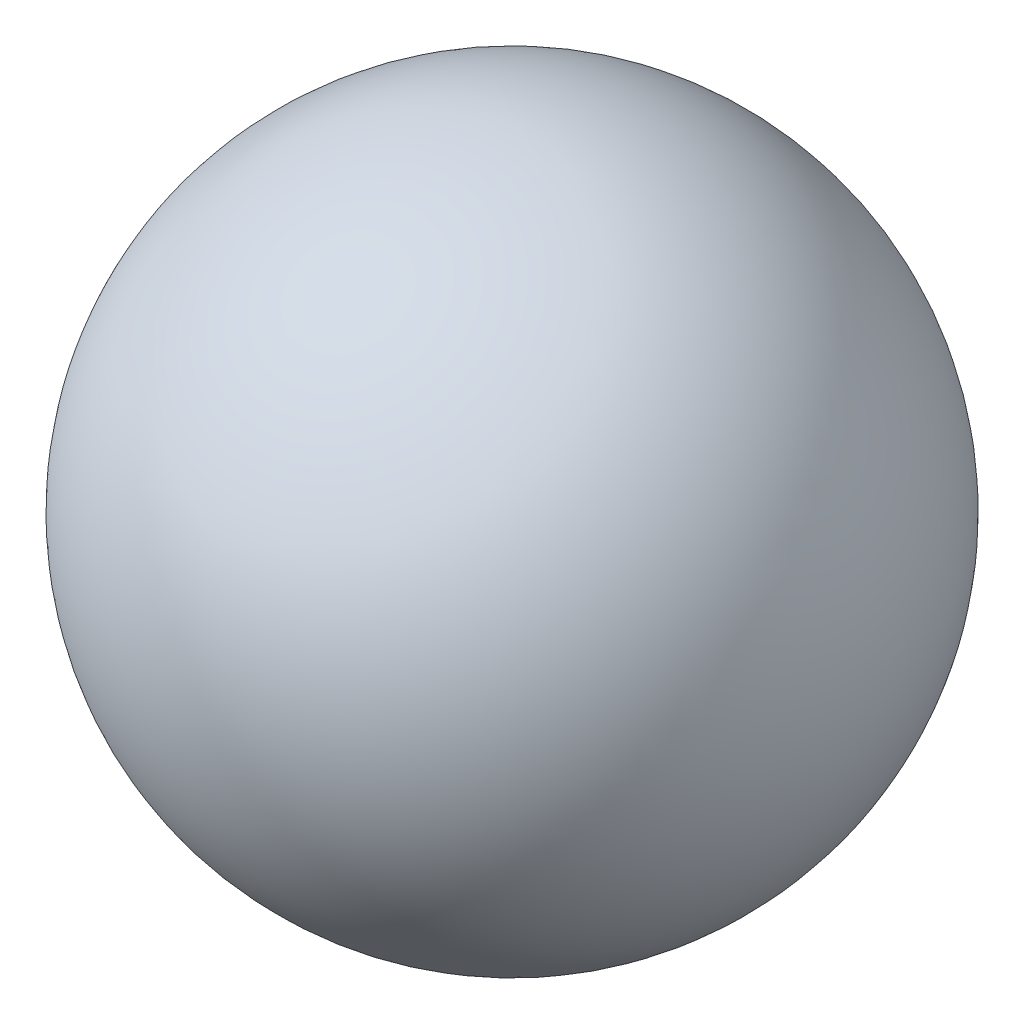
ISO-10303-21;
HEADER;
FILE_DESCRIPTION(('STEP AP214'),'2;1');
FILE_NAME('part.step','',(''),(''),'','','');
FILE_SCHEMA(('AUTOMOTIVE_DESIGN { 1 0 10303 214 1 1 1 1 }'));
ENDSEC;
DATA;
#1=APPLICATION_CONTEXT('core data for automotive mechanical design processes');
#2=APPLICATION_PROTOCOL_DEFINITION('international standard','automotive_design',2000,#1);
#3=PRODUCT_CONTEXT('',#1,'mechanical');
#4=PRODUCT('Part','Part','',(#3));
#5=PRODUCT_RELATED_PRODUCT_CATEGORY('part','',(#4));
#6=PRODUCT_DEFINITION_FORMATION('','',#4);
#7=PRODUCT_DEFINITION_CONTEXT('part definition',#1,'design');
#8=PRODUCT_DEFINITION('design','',#6,#7);
#9=PRODUCT_DEFINITION_SHAPE('','',#8);
#10=(LENGTH_UNIT() NAMED_UNIT(*) SI_UNIT(.MILLI.,.METRE.));
#11=(NAMED_UNIT(*) PLANE_ANGLE_UNIT() SI_UNIT($,.RADIAN.));
#12=(NAMED_UNIT(*) SI_UNIT($,.STERADIAN.) SOLID_ANGLE_UNIT());
#13=UNCERTAINTY_MEASURE_WITH_UNIT(LENGTH_MEASURE(1.E-05),#10,'distance_accuracy_value','');
#14=(GEOMETRIC_REPRESENTATION_CONTEXT(3) GLOBAL_UNCERTAINTY_ASSIGNED_CONTEXT((#13)) GLOBAL_UNIT_ASSIGNED_CONTEXT((#10,
#11,#12)) REPRESENTATION_CONTEXT('',''));
#15=CARTESIAN_POINT('',(0.,0.,0.));
#16=DIRECTION('',(0.,0.,1.));
#17=DIRECTION('',(1.,0.,0.));
#18=AXIS2_PLACEMENT_3D('',#15,#16,#17);
#19=CARTESIAN_POINT('',(0.,0.,0.));
#20=DIRECTION('',(1.,0.,0.));
#21=DIRECTION('',(0.,-1.,0.));
#22=AXIS2_PLACEMENT_3D('',#19,#20,#21);
#23=SPHERICAL_SURFACE('',#22,25.5);
#24=CARTESIAN_POINT('',(25.5,0.,0.));
#25=VERTEX_POINT('',#24);
#26=VERTEX_LOOP('',#25);
#27=FACE_BOUND('',#26,.T.);
#28=ADVANCED_FACE('F38',(#27),#23,.T.);
#29=CLOSED_SHELL('',(#28));
#30=CARTESIAN_POINT('',(0.,0.,0.));
#31=DIRECTION('',(1.,0.,0.));
#32=DIRECTION('',(0.,-1.,0.));
#33=AXIS2_PLACEMENT_3D('',#30,#31,#32);
#34=SPHERICAL_SURFACE('',#33,5.);
#35=CARTESIAN_POINT('',(0.,0.,-4.44322333746908));
#36=DIRECTION('',(0.,0.,1.));
#37=DIRECTION('',(1.,0.,0.));
#38=AXIS2_PLACEMENT_3D('',#35,#36,#37);
#39=CIRCLE('',#38,2.29298198278358);
#40=CARTESIAN_POINT('',(2.29298198278358,0.,-4.44322333746908));
#41=VERTEX_POINT('',#40);
#42=EDGE_CURVE('E10',#41,#41,#39,.T.);
#43=ORIENTED_EDGE('',*,*,#42,.T.);
#44=EDGE_LOOP('',(#43));
#45=FACE_BOUND('',#44,.T.);
#46=CARTESIAN_POINT('',(0.,4.44322333746908,0.));
#47=DIRECTION('',(0.,-1.,0.));
#48=DIRECTION('',(1.,0.,0.));
#49=AXIS2_PLACEMENT_3D('',#46,#47,#48);
#50=CIRCLE('',#49,2.29298198278358);
#51=CARTESIAN_POINT('',(2.29298198278358,4.44322333746908,0.));
#52=VERTEX_POINT('',#51);
#53=EDGE_CURVE('E75',#52,#52,#50,.T.);
#54=ORIENTED_EDGE('',*,*,#53,.T.);
#55=EDGE_LOOP('',(#54));
#56=FACE_BOUND('',#55,.T.);
#57=CARTESIAN_POINT('',(4.44322333746908,0.,0.));
#58=DIRECTION('',(-1.,0.,0.));
#59=DIRECTION('',(0.,0.,1.));
#60=AXIS2_PLACEMENT_3D('',#57,#58,#59);
#61=CIRCLE('',#60,2.29298198278358);
#62=CARTESIAN_POINT('',(4.44322333746908,0.,2.29298198278358));
#63=VERTEX_POINT('',#62);
#64=EDGE_CURVE('E99',#63,#63,#61,.T.);
#65=ORIENTED_EDGE('',*,*,#64,.T.);
#66=EDGE_LOOP('',(#65));
#67=FACE_BOUND('',#66,.T.);
#68=CARTESIAN_POINT('',(-4.44322333746908,0.,0.));
#69=DIRECTION('',(1.,0.,0.));
#70=DIRECTION('',(0.,0.,-1.));
#71=AXIS2_PLACEMENT_3D('',#68,#69,#70);
#72=CIRCLE('',#71,2.29298198278358);
#73=CARTESIAN_POINT('',(-4.44322333746908,0.,-2.29298198278358));
#74=VERTEX_POINT('',#73);
#75=EDGE_CURVE('E111',#74,#74,#72,.T.);
#76=ORIENTED_EDGE('',*,*,#75,.T.);
#77=EDGE_LOOP('',(#76));
#78=FACE_BOUND('',#77,.T.);
#79=CARTESIAN_POINT('',(0.,-4.44322333746908,0.));
#80=DIRECTION('',(0.,1.,0.));
#81=DIRECTION('',(-1.,0.,0.));
#82=AXIS2_PLACEMENT_3D('',#79,#80,#81);
#83=CIRCLE('',#82,2.29298198278358);
#84=CARTESIAN_POINT('',(-2.29298198278358,-4.44322333746908,0.));
#85=VERTEX_POINT('',#84);
#86=EDGE_CURVE('E87',#85,#85,#83,.T.);
#87=ORIENTED_EDGE('',*,*,#86,.T.);
#88=EDGE_LOOP('',(#87));
#89=FACE_BOUND('',#88,.T.);
#90=CARTESIAN_POINT('',(0.,0.,4.44322333746908));
#91=DIRECTION('',(0.,0.,-1.));
#92=DIRECTION('',(-1.,0.,0.));
#93=AXIS2_PLACEMENT_3D('',#90,#91,#92);
#94=CIRCLE('',#93,2.29298198278358);
#95=CARTESIAN_POINT('',(-2.29298198278358,0.,4.44322333746908));
#96=VERTEX_POINT('',#95);
#97=EDGE_CURVE('E63',#96,#96,#94,.T.);
#98=ORIENTED_EDGE('',*,*,#97,.T.);
#99=EDGE_LOOP('',(#98));
#100=FACE_BOUND('',#99,.T.);
#101=ADVANCED_FACE('F145',(#45,#56,#67,#78,#89,#100),#34,.T.);
#102=CARTESIAN_POINT('',(0.,0.,0.));
#103=DIRECTION('',(1.,0.,0.));
#104=DIRECTION('',(0.,-1.,0.));
#105=AXIS2_PLACEMENT_3D('',#102,#103,#104);
#106=SPHERICAL_SURFACE('',#105,25.);
#107=CARTESIAN_POINT('',(0.,0.,-22.2766061907567));
#108=DIRECTION('',(0.,0.,1.));
#109=DIRECTION('',(1.,0.,0.));
#110=AXIS2_PLACEMENT_3D('',#107,#108,#109);
#111=CIRCLE('',#110,11.3469298324234);
#112=CARTESIAN_POINT('',(11.3469298324233,0.,-22.2766061907567));
#113=VERTEX_POINT('',#112);
#114=EDGE_CURVE('E53',#113,#113,#111,.F.);
#115=ORIENTED_EDGE('',*,*,#114,.T.);
#116=EDGE_LOOP('',(#115));
#117=FACE_BOUND('',#116,.T.);
#118=CARTESIAN_POINT('',(0.,22.2766061907567,0.));
#119=DIRECTION('',(0.,-1.,0.));
#120=DIRECTION('',(1.,0.,0.));
#121=AXIS2_PLACEMENT_3D('',#118,#119,#120);
#122=CIRCLE('',#121,11.3469298324233);
#123=CARTESIAN_POINT('',(11.3469298324233,22.2766061907567,0.));
#124=VERTEX_POINT('',#123);
#125=EDGE_CURVE('E81',#124,#124,#122,.F.);
#126=ORIENTED_EDGE('',*,*,#125,.T.);
#127=EDGE_LOOP('',(#126));
#128=FACE_BOUND('',#127,.T.);
#129=CARTESIAN_POINT('',(22.2766061907567,0.,0.));
#130=DIRECTION('',(-1.,0.,0.));
#131=DIRECTION('',(0.,0.,1.));
#132=AXIS2_PLACEMENT_3D('',#129,#130,#131);
#133=CIRCLE('',#132,11.3469298324233);
#134=CARTESIAN_POINT('',(22.2766061907567,0.,11.3469298324233));
#135=VERTEX_POINT('',#134);
#136=EDGE_CURVE('E105',#135,#135,#133,.F.);
#137=ORIENTED_EDGE('',*,*,#136,.T.);
#138=EDGE_LOOP('',(#137));
#139=FACE_BOUND('',#138,.T.);
#140=CARTESIAN_POINT('',(-22.2766061907567,0.,0.));
#141=DIRECTION('',(1.,0.,0.));
#142=DIRECTION('',(0.,0.,-1.));
#143=AXIS2_PLACEMENT_3D('',#140,#141,#142);
#144=CIRCLE('',#143,11.3469298324233);
#145=CARTESIAN_POINT('',(-22.2766061907567,0.,-11.3469298324233));
#146=VERTEX_POINT('',#145);
#147=EDGE_CURVE('E121',#146,#146,#144,.F.);
#148=ORIENTED_EDGE('',*,*,#147,.T.);
#149=EDGE_LOOP('',(#148));
#150=FACE_BOUND('',#149,.T.);
#151=CARTESIAN_POINT('',(0.,-22.2766061907567,0.));
#152=DIRECTION('',(0.,1.,0.));
#153=DIRECTION('',(-1.,0.,0.));
#154=AXIS2_PLACEMENT_3D('',#151,#152,#153);
#155=CIRCLE('',#154,11.3469298324233);
#156=CARTESIAN_POINT('',(-11.3469298324234,-22.2766061907567,0.));
#157=VERTEX_POINT('',#156);
#158=EDGE_CURVE('E93',#157,#157,#155,.F.);
#159=ORIENTED_EDGE('',*,*,#158,.T.);
#160=EDGE_LOOP('',(#159));
#161=FACE_BOUND('',#160,.T.);
#162=CARTESIAN_POINT('',(0.,0.,22.2766061907567));
#163=DIRECTION('',(0.,0.,-1.));
#164=DIRECTION('',(-1.,0.,0.));
#165=AXIS2_PLACEMENT_3D('',#162,#163,#164);
#166=CIRCLE('',#165,11.3469298324234);
#167=CARTESIAN_POINT('',(-11.3469298324233,0.,22.2766061907567));
#168=VERTEX_POINT('',#167);
#169=EDGE_CURVE('E69',#168,#168,#166,.F.);
#170=ORIENTED_EDGE('',*,*,#169,.T.);
#171=EDGE_LOOP('',(#170));
#172=FACE_BOUND('',#171,.T.);
#173=ADVANCED_FACE('F141',(#117,#128,#139,#150,#161,#172),#106,.F.);
#174=CARTESIAN_POINT('',(-25.,2.,0.));
#175=CARTESIAN_POINT('',(-15.9439065547574,-0.257937692263543,0.));
#176=CARTESIAN_POINT('',(-9.05609344524264,-0.257937692263541,0.));
#177=CARTESIAN_POINT('',(0.,2.,0.));
#178=B_SPLINE_CURVE_WITH_KNOTS('',3,(#174,#175,#176,#177),.UNSPECIFIED.,.F.,.F.,(4,4),(0.,1.),.UNSPECIFIED.);
#179=CARTESIAN_POINT('',(0.,0.,0.));
#180=DIRECTION('',(1.,0.,0.));
#181=AXIS1_PLACEMENT('',#179,#180);
#182=SURFACE_OF_REVOLUTION('',#178,#181);
#183=CARTESIAN_POINT('',(-6.71817886282011,0.,0.));
#184=DIRECTION('',(1.,0.,0.));
#185=DIRECTION('',(0.,0.,-1.));
#186=AXIS2_PLACEMENT_3D('',#183,#184,#185);
#187=CIRCLE('',#186,0.694357645315852);
#188=CARTESIAN_POINT('',(-6.71817886282011,0.,-0.694357645315852));
#189=VERTEX_POINT('',#188);
#190=EDGE_CURVE('E114',#189,#189,#187,.F.);
#191=ORIENTED_EDGE('',*,*,#190,.T.);
#192=EDGE_LOOP('',(#191));
#193=FACE_BOUND('',#192,.T.);
#194=CARTESIAN_POINT('',(-16.244846792707,0.,0.));
#195=DIRECTION('',(1.,0.,0.));
#196=DIRECTION('',(0.,0.,-1.));
#197=AXIS2_PLACEMENT_3D('',#194,#195,#196);
#198=CIRCLE('',#197,0.471177087042309);
#199=CARTESIAN_POINT('',(-16.244846792707,0.,-0.471177087042309));
#200=VERTEX_POINT('',#199);
#201=EDGE_CURVE('E118',#200,#200,#198,.T.);
#202=ORIENTED_EDGE('',*,*,#201,.T.);
#203=EDGE_LOOP('',(#202));
#204=FACE_BOUND('',#203,.T.);
#205=ADVANCED_FACE('F136',(#193,#204),#182,.T.);
#206=CARTESIAN_POINT('',(-15.5936243335297,0.,0.));
#207=DIRECTION('',(1.,0.,0.));
#208=DIRECTION('',(0.,0.,-1.));
#209=AXIS2_PLACEMENT_3D('',#206,#207,#208);
#210=TOROIDAL_SURFACE('',#209,7.94285088269634,7.5);
#211=ORIENTED_EDGE('',*,*,#201,.F.);
#212=EDGE_LOOP('',(#211));
#213=FACE_BOUND('',#212,.T.);
#214=ORIENTED_EDGE('',*,*,#147,.F.);
#215=EDGE_LOOP('',(#214));
#216=FACE_BOUND('',#215,.T.);
#217=ADVANCED_FACE('F140',(#213,#216),#210,.F.);
#218=CARTESIAN_POINT('',(-7.10915733995053,0.,0.));
#219=DIRECTION('',(1.,0.,0.));
#220=DIRECTION('',(0.,0.,-1.));
#221=AXIS2_PLACEMENT_3D('',#218,#219,#220);
#222=TOROIDAL_SURFACE('',#221,3.66877117245373,3.);
#223=ORIENTED_EDGE('',*,*,#75,.F.);
#224=EDGE_LOOP('',(#223));
#225=FACE_BOUND('',#224,.T.);
#226=ORIENTED_EDGE('',*,*,#190,.F.);
#227=EDGE_LOOP('',(#226));
#228=FACE_BOUND('',#227,.T.);
#229=ADVANCED_FACE('F150',(#225,#228),#222,.F.);
#230=CARTESIAN_POINT('',(25.,2.,0.));
#231=CARTESIAN_POINT('',(15.9439065547574,-0.257937692263543,0.));
#232=CARTESIAN_POINT('',(9.05609344524264,-0.257937692263541,0.));
#233=CARTESIAN_POINT('',(0.,2.,0.));
#234=B_SPLINE_CURVE_WITH_KNOTS('',3,(#230,#231,#232,#233),.UNSPECIFIED.,.F.,.F.,(4,4),(0.,1.),.UNSPECIFIED.);
#235=CARTESIAN_POINT('',(0.,0.,0.));
#236=DIRECTION('',(-1.,0.,0.));
#237=AXIS1_PLACEMENT('',#235,#236);
#238=SURFACE_OF_REVOLUTION('',#234,#237);
#239=CARTESIAN_POINT('',(6.71817886282011,0.,0.));
#240=DIRECTION('',(-1.,0.,0.));
#241=DIRECTION('',(0.,0.,1.));
#242=AXIS2_PLACEMENT_3D('',#239,#240,#241);
#243=CIRCLE('',#242,0.694357645315852);
#244=CARTESIAN_POINT('',(6.71817886282011,0.,0.694357645315852));
#245=VERTEX_POINT('',#244);
#246=EDGE_CURVE('E102',#245,#245,#243,.F.);
#247=ORIENTED_EDGE('',*,*,#246,.T.);
#248=EDGE_LOOP('',(#247));
#249=FACE_BOUND('',#248,.T.);
#250=CARTESIAN_POINT('',(16.244846792707,0.,0.));
#251=DIRECTION('',(-1.,0.,0.));
#252=DIRECTION('',(0.,0.,1.));
#253=AXIS2_PLACEMENT_3D('',#250,#251,#252);
#254=CIRCLE('',#253,0.47117708704231);
#255=CARTESIAN_POINT('',(16.244846792707,0.,0.47117708704231));
#256=VERTEX_POINT('',#255);
#257=EDGE_CURVE('E108',#256,#256,#254,.T.);
#258=ORIENTED_EDGE('',*,*,#257,.T.);
#259=EDGE_LOOP('',(#258));
#260=FACE_BOUND('',#259,.T.);
#261=ADVANCED_FACE('F154',(#249,#260),#238,.T.);
#262=CARTESIAN_POINT('',(15.5936243335297,0.,0.));
#263=DIRECTION('',(-1.,0.,0.));
#264=DIRECTION('',(0.,0.,1.));
#265=AXIS2_PLACEMENT_3D('',#262,#263,#264);
#266=TOROIDAL_SURFACE('',#265,7.94285088269634,7.5);
#267=ORIENTED_EDGE('',*,*,#136,.F.);
#268=EDGE_LOOP('',(#267));
#269=FACE_BOUND('',#268,.T.);
#270=ORIENTED_EDGE('',*,*,#257,.F.);
#271=EDGE_LOOP('',(#270));
#272=FACE_BOUND('',#271,.T.);
#273=ADVANCED_FACE('F156',(#269,#272),#266,.F.);
#274=CARTESIAN_POINT('',(7.10915733995053,0.,0.));
#275=DIRECTION('',(-1.,0.,0.));
#276=DIRECTION('',(0.,0.,1.));
#277=AXIS2_PLACEMENT_3D('',#274,#275,#276);
#278=TOROIDAL_SURFACE('',#277,3.66877117245373,3.);
#279=ORIENTED_EDGE('',*,*,#64,.F.);
#280=EDGE_LOOP('',(#279));
#281=FACE_BOUND('',#280,.T.);
#282=ORIENTED_EDGE('',*,*,#246,.F.);
#283=EDGE_LOOP('',(#282));
#284=FACE_BOUND('',#283,.T.);
#285=ADVANCED_FACE('F159',(#281,#284),#278,.F.);
#286=CARTESIAN_POINT('',(-2.,-25.,0.));
#287=CARTESIAN_POINT('',(0.257937692263539,-15.9439065547574,0.));
#288=CARTESIAN_POINT('',(0.257937692263539,-9.05609344524264,0.));
#289=CARTESIAN_POINT('',(-2.,0.,0.));
#290=B_SPLINE_CURVE_WITH_KNOTS('',3,(#286,#287,#288,#289),.UNSPECIFIED.,.F.,.F.,(4,4),(0.,1.),.UNSPECIFIED.);
#291=CARTESIAN_POINT('',(0.,0.,0.));
#292=DIRECTION('',(0.,1.,0.));
#293=AXIS1_PLACEMENT('',#291,#292);
#294=SURFACE_OF_REVOLUTION('',#290,#293);
#295=CARTESIAN_POINT('',(0.,-6.71817886282011,0.));
#296=DIRECTION('',(0.,1.,0.));
#297=DIRECTION('',(-1.,0.,0.));
#298=AXIS2_PLACEMENT_3D('',#295,#296,#297);
#299=CIRCLE('',#298,0.694357645315852);
#300=CARTESIAN_POINT('',(-0.694357645315854,-6.71817886282011,0.));
#301=VERTEX_POINT('',#300);
#302=EDGE_CURVE('E90',#301,#301,#299,.F.);
#303=ORIENTED_EDGE('',*,*,#302,.T.);
#304=EDGE_LOOP('',(#303));
#305=FACE_BOUND('',#304,.T.);
#306=CARTESIAN_POINT('',(0.,-16.2448467927069,0.));
#307=DIRECTION('',(0.,1.,0.));
#308=DIRECTION('',(-1.,0.,0.));
#309=AXIS2_PLACEMENT_3D('',#306,#307,#308);
#310=CIRCLE('',#309,0.47117708704231);
#311=CARTESIAN_POINT('',(-0.471177087042313,-16.2448467927069,0.));
#312=VERTEX_POINT('',#311);
#313=EDGE_CURVE('E96',#312,#312,#310,.T.);
#314=ORIENTED_EDGE('',*,*,#313,.T.);
#315=EDGE_LOOP('',(#314));
#316=FACE_BOUND('',#315,.T.);
#317=ADVANCED_FACE('F163',(#305,#316),#294,.T.);
#318=CARTESIAN_POINT('',(0.,-15.5936243335297,0.));
#319=DIRECTION('',(0.,1.,0.));
#320=DIRECTION('',(-1.,0.,0.));
#321=AXIS2_PLACEMENT_3D('',#318,#319,#320);
#322=TOROIDAL_SURFACE('',#321,7.94285088269634,7.5);
#323=ORIENTED_EDGE('',*,*,#158,.F.);
#324=EDGE_LOOP('',(#323));
#325=FACE_BOUND('',#324,.T.);
#326=ORIENTED_EDGE('',*,*,#313,.F.);
#327=EDGE_LOOP('',(#326));
#328=FACE_BOUND('',#327,.T.);
#329=ADVANCED_FACE('F165',(#325,#328),#322,.F.);
#330=CARTESIAN_POINT('',(0.,-7.10915733995053,0.));
#331=DIRECTION('',(0.,1.,0.));
#332=DIRECTION('',(-1.,0.,0.));
#333=AXIS2_PLACEMENT_3D('',#330,#331,#332);
#334=TOROIDAL_SURFACE('',#333,3.66877117245373,3.);
#335=ORIENTED_EDGE('',*,*,#86,.F.);
#336=EDGE_LOOP('',(#335));
#337=FACE_BOUND('',#336,.T.);
#338=ORIENTED_EDGE('',*,*,#302,.F.);
#339=EDGE_LOOP('',(#338));
#340=FACE_BOUND('',#339,.T.);
#341=ADVANCED_FACE('F168',(#337,#340),#334,.F.);
#342=CARTESIAN_POINT('',(-1.99999999999999,25.,0.));
#343=CARTESIAN_POINT('',(0.257937692263547,15.9439065547574,0.));
#344=CARTESIAN_POINT('',(0.257937692263543,9.05609344524264,0.));
#345=CARTESIAN_POINT('',(-2.,0.,0.));
#346=B_SPLINE_CURVE_WITH_KNOTS('',3,(#342,#343,#344,#345),.UNSPECIFIED.,.F.,.F.,(4,4),(0.,1.),.UNSPECIFIED.);
#347=CARTESIAN_POINT('',(0.,0.,0.));
#348=DIRECTION('',(0.,-1.,0.));
#349=AXIS1_PLACEMENT('',#347,#348);
#350=SURFACE_OF_REVOLUTION('',#346,#349);
#351=CARTESIAN_POINT('',(0.,6.71817886282011,0.));
#352=DIRECTION('',(0.,-1.,0.));
#353=DIRECTION('',(1.,0.,0.));
#354=AXIS2_PLACEMENT_3D('',#351,#352,#353);
#355=CIRCLE('',#354,0.694357645315852);
#356=CARTESIAN_POINT('',(0.694357645315854,6.71817886282011,0.));
#357=VERTEX_POINT('',#356);
#358=EDGE_CURVE('E78',#357,#357,#355,.F.);
#359=ORIENTED_EDGE('',*,*,#358,.T.);
#360=EDGE_LOOP('',(#359));
#361=FACE_BOUND('',#360,.T.);
#362=CARTESIAN_POINT('',(0.,16.244846792707,0.));
#363=DIRECTION('',(0.,-1.,0.));
#364=DIRECTION('',(1.,0.,0.));
#365=AXIS2_PLACEMENT_3D('',#362,#363,#364);
#366=CIRCLE('',#365,0.471177087042311);
#367=CARTESIAN_POINT('',(0.471177087042314,16.244846792707,0.));
#368=VERTEX_POINT('',#367);
#369=EDGE_CURVE('E84',#368,#368,#366,.T.);
#370=ORIENTED_EDGE('',*,*,#369,.T.);
#371=EDGE_LOOP('',(#370));
#372=FACE_BOUND('',#371,.T.);
#373=ADVANCED_FACE('F172',(#361,#372),#350,.T.);
#374=CARTESIAN_POINT('',(0.,15.5936243335297,0.));
#375=DIRECTION('',(0.,-1.,0.));
#376=DIRECTION('',(1.,0.,0.));
#377=AXIS2_PLACEMENT_3D('',#374,#375,#376);
#378=TOROIDAL_SURFACE('',#377,7.94285088269634,7.5);
#379=ORIENTED_EDGE('',*,*,#125,.F.);
#380=EDGE_LOOP('',(#379));
#381=FACE_BOUND('',#380,.T.);
#382=ORIENTED_EDGE('',*,*,#369,.F.);
#383=EDGE_LOOP('',(#382));
#384=FACE_BOUND('',#383,.T.);
#385=ADVANCED_FACE('F174',(#381,#384),#378,.F.);
#386=CARTESIAN_POINT('',(0.,7.10915733995053,0.));
#387=DIRECTION('',(0.,-1.,0.));
#388=DIRECTION('',(1.,0.,0.));
#389=AXIS2_PLACEMENT_3D('',#386,#387,#388);
#390=TOROIDAL_SURFACE('',#389,3.66877117245373,3.);
#391=ORIENTED_EDGE('',*,*,#53,.F.);
#392=EDGE_LOOP('',(#391));
#393=FACE_BOUND('',#392,.T.);
#394=ORIENTED_EDGE('',*,*,#358,.F.);
#395=EDGE_LOOP('',(#394));
#396=FACE_BOUND('',#395,.T.);
#397=ADVANCED_FACE('F177',(#393,#396),#390,.F.);
#398=CARTESIAN_POINT('',(0.,2.,25.));
#399=CARTESIAN_POINT('',(0.,-0.257937692263543,15.9439065547574));
#400=CARTESIAN_POINT('',(0.,-0.257937692263541,9.05609344524264));
#401=CARTESIAN_POINT('',(0.,2.,0.));
#402=B_SPLINE_CURVE_WITH_KNOTS('',3,(#398,#399,#400,#401),.UNSPECIFIED.,.F.,.F.,(4,4),(0.,1.),.UNSPECIFIED.);
#403=CARTESIAN_POINT('',(0.,0.,0.));
#404=DIRECTION('',(0.,0.,-1.));
#405=AXIS1_PLACEMENT('',#403,#404);
#406=SURFACE_OF_REVOLUTION('',#402,#405);
#407=CARTESIAN_POINT('',(0.,0.,6.71817886282011));
#408=DIRECTION('',(0.,0.,-1.));
#409=DIRECTION('',(-1.,0.,0.));
#410=AXIS2_PLACEMENT_3D('',#407,#408,#409);
#411=CIRCLE('',#410,0.694357645315852);
#412=CARTESIAN_POINT('',(-0.694357645315851,0.,6.71817886282011));
#413=VERTEX_POINT('',#412);
#414=EDGE_CURVE('E66',#413,#413,#411,.F.);
#415=ORIENTED_EDGE('',*,*,#414,.T.);
#416=EDGE_LOOP('',(#415));
#417=FACE_BOUND('',#416,.T.);
#418=CARTESIAN_POINT('',(0.,0.,16.2448467927069));
#419=DIRECTION('',(0.,0.,-1.));
#420=DIRECTION('',(-1.,0.,0.));
#421=AXIS2_PLACEMENT_3D('',#418,#419,#420);
#422=CIRCLE('',#421,0.471177087042309);
#423=CARTESIAN_POINT('',(-0.471177087042306,0.,16.2448467927069));
#424=VERTEX_POINT('',#423);
#425=EDGE_CURVE('E72',#424,#424,#422,.T.);
#426=ORIENTED_EDGE('',*,*,#425,.T.);
#427=EDGE_LOOP('',(#426));
#428=FACE_BOUND('',#427,.T.);
#429=ADVANCED_FACE('F181',(#417,#428),#406,.T.);
#430=CARTESIAN_POINT('',(0.,0.,15.5936243335297));
#431=DIRECTION('',(0.,0.,-1.));
#432=DIRECTION('',(-1.,0.,0.));
#433=AXIS2_PLACEMENT_3D('',#430,#431,#432);
#434=TOROIDAL_SURFACE('',#433,7.94285088269634,7.5);
#435=ORIENTED_EDGE('',*,*,#169,.F.);
#436=EDGE_LOOP('',(#435));
#437=FACE_BOUND('',#436,.T.);
#438=ORIENTED_EDGE('',*,*,#425,.F.);
#439=EDGE_LOOP('',(#438));
#440=FACE_BOUND('',#439,.T.);
#441=ADVANCED_FACE('F183',(#437,#440),#434,.F.);
#442=CARTESIAN_POINT('',(0.,0.,7.10915733995053));
#443=DIRECTION('',(0.,0.,-1.));
#444=DIRECTION('',(-1.,0.,0.));
#445=AXIS2_PLACEMENT_3D('',#442,#443,#444);
#446=TOROIDAL_SURFACE('',#445,3.66877117245373,3.);
#447=ORIENTED_EDGE('',*,*,#97,.F.);
#448=EDGE_LOOP('',(#447));
#449=FACE_BOUND('',#448,.T.);
#450=ORIENTED_EDGE('',*,*,#414,.F.);
#451=EDGE_LOOP('',(#450));
#452=FACE_BOUND('',#451,.T.);
#453=ADVANCED_FACE('F186',(#449,#452),#446,.F.);
#454=CARTESIAN_POINT('',(0.,2.,-25.));
#455=CARTESIAN_POINT('',(0.,-0.257937692263543,-15.9439065547574));
#456=CARTESIAN_POINT('',(0.,-0.257937692263541,-9.05609344524264));
#457=CARTESIAN_POINT('',(0.,2.,0.));
#458=B_SPLINE_CURVE_WITH_KNOTS('',3,(#454,#455,#456,#457),.UNSPECIFIED.,.F.,.F.,(4,4),(0.,1.),.UNSPECIFIED.);
#459=CARTESIAN_POINT('',(0.,0.,0.));
#460=DIRECTION('',(0.,0.,1.));
#461=AXIS1_PLACEMENT('',#459,#460);
#462=SURFACE_OF_REVOLUTION('',#458,#461);
#463=CARTESIAN_POINT('',(0.,0.,-6.71817886282011));
#464=DIRECTION('',(0.,0.,1.));
#465=DIRECTION('',(1.,0.,0.));
#466=AXIS2_PLACEMENT_3D('',#463,#464,#465);
#467=CIRCLE('',#466,0.694357645315852);
#468=CARTESIAN_POINT('',(0.694357645315851,0.,-6.71817886282011));
#469=VERTEX_POINT('',#468);
#470=EDGE_CURVE('E47',#469,#469,#467,.F.);
#471=ORIENTED_EDGE('',*,*,#470,.T.);
#472=EDGE_LOOP('',(#471));
#473=FACE_BOUND('',#472,.T.);
#474=CARTESIAN_POINT('',(0.,0.,-16.2448467927069));
#475=DIRECTION('',(0.,0.,1.));
#476=DIRECTION('',(1.,0.,0.));
#477=AXIS2_PLACEMENT_3D('',#474,#475,#476);
#478=CIRCLE('',#477,0.471177087042309);
#479=CARTESIAN_POINT('',(0.471177087042306,0.,-16.2448467927069));
#480=VERTEX_POINT('',#479);
#481=EDGE_CURVE('E58',#480,#480,#478,.T.);
#482=ORIENTED_EDGE('',*,*,#481,.T.);
#483=EDGE_LOOP('',(#482));
#484=FACE_BOUND('',#483,.T.);
#485=ADVANCED_FACE('F189',(#473,#484),#462,.T.);
#486=CARTESIAN_POINT('',(0.,0.,-15.5936243335297));
#487=DIRECTION('',(0.,0.,1.));
#488=DIRECTION('',(1.,0.,0.));
#489=AXIS2_PLACEMENT_3D('',#486,#487,#488);
#490=TOROIDAL_SURFACE('',#489,7.94285088269634,7.5);
#491=ORIENTED_EDGE('',*,*,#114,.F.);
#492=EDGE_LOOP('',(#491));
#493=FACE_BOUND('',#492,.T.);
#494=ORIENTED_EDGE('',*,*,#481,.F.);
#495=EDGE_LOOP('',(#494));
#496=FACE_BOUND('',#495,.T.);
#497=ADVANCED_FACE('F191',(#493,#496),#490,.F.);
#498=CARTESIAN_POINT('',(0.,0.,-7.10915733995053));
#499=DIRECTION('',(0.,0.,1.));
#500=DIRECTION('',(1.,0.,0.));
#501=AXIS2_PLACEMENT_3D('',#498,#499,#500);
#502=TOROIDAL_SURFACE('',#501,3.66877117245373,3.);
#503=ORIENTED_EDGE('',*,*,#42,.F.);
#504=EDGE_LOOP('',(#503));
#505=FACE_BOUND('',#504,.T.);
#506=ORIENTED_EDGE('',*,*,#470,.F.);
#507=EDGE_LOOP('',(#506));
#508=FACE_BOUND('',#507,.T.);
#509=ADVANCED_FACE('F40',(#505,#508),#502,.F.);
#510=CLOSED_SHELL('',(#101,#173,#205,#217,#229,#261,#273,#285,#317,#329,#341,#373,#385,#397,
#429,#441,#453,#485,#497,#509));
#511=ORIENTED_CLOSED_SHELL('',*,#510,.T.);
#512=BREP_WITH_VOIDS('B2',#29,(#511));
#513=ADVANCED_BREP_SHAPE_REPRESENTATION('',(#18,#512),#14);
#514=SHAPE_DEFINITION_REPRESENTATION(#9,#513);
ENDSEC;
END-ISO-10303-21;
